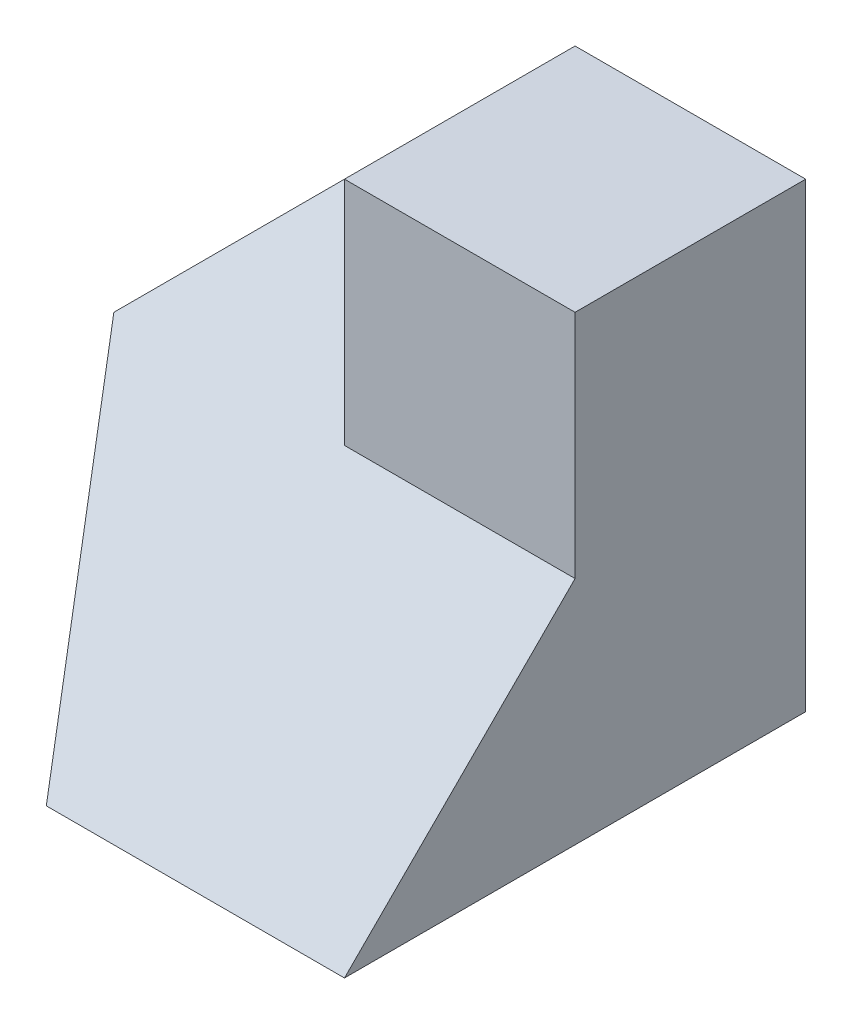
ISO-10303-21;
HEADER;
FILE_DESCRIPTION(('STEP AP214'),'2;1');
FILE_NAME('part.step','',(''),(''),'','','');
FILE_SCHEMA(('AUTOMOTIVE_DESIGN { 1 0 10303 214 1 1 1 1 }'));
ENDSEC;
DATA;
#1=APPLICATION_CONTEXT('core data for automotive mechanical design processes');
#2=APPLICATION_PROTOCOL_DEFINITION('international standard','automotive_design',2000,#1);
#3=PRODUCT_CONTEXT('',#1,'mechanical');
#4=PRODUCT('Part','Part','',(#3));
#5=PRODUCT_RELATED_PRODUCT_CATEGORY('part','',(#4));
#6=PRODUCT_DEFINITION_FORMATION('','',#4);
#7=PRODUCT_DEFINITION_CONTEXT('part definition',#1,'design');
#8=PRODUCT_DEFINITION('design','',#6,#7);
#9=PRODUCT_DEFINITION_SHAPE('','',#8);
#10=(LENGTH_UNIT() NAMED_UNIT(*) SI_UNIT(.MILLI.,.METRE.));
#11=(NAMED_UNIT(*) PLANE_ANGLE_UNIT() SI_UNIT($,.RADIAN.));
#12=(NAMED_UNIT(*) SI_UNIT($,.STERADIAN.) SOLID_ANGLE_UNIT());
#13=UNCERTAINTY_MEASURE_WITH_UNIT(LENGTH_MEASURE(1.E-05),#10,'distance_accuracy_value','');
#14=(GEOMETRIC_REPRESENTATION_CONTEXT(3) GLOBAL_UNCERTAINTY_ASSIGNED_CONTEXT((#13)) GLOBAL_UNIT_ASSIGNED_CONTEXT((#10,
#11,#12)) REPRESENTATION_CONTEXT('',''));
#15=CARTESIAN_POINT('',(0.,0.,0.));
#16=DIRECTION('',(0.,0.,1.));
#17=DIRECTION('',(1.,0.,0.));
#18=AXIS2_PLACEMENT_3D('',#15,#16,#17);
#19=CARTESIAN_POINT('',(0.,0.,40.));
#20=DIRECTION('',(1.,0.,0.));
#21=DIRECTION('',(0.,0.,-1.));
#22=AXIS2_PLACEMENT_3D('',#19,#20,#21);
#23=PLANE('',#22);
#24=DIRECTION('',(0.,-1.,0.));
#25=VECTOR('',#24,1.);
#26=CARTESIAN_POINT('',(0.,0.,0.));
#27=LINE('',#26,#25);
#28=CARTESIAN_POINT('',(0.,20.,0.));
#29=VERTEX_POINT('',#28);
#30=CARTESIAN_POINT('',(0.,-5.34294830600857E-13,0.));
#31=VERTEX_POINT('',#30);
#32=EDGE_CURVE('E124',#29,#31,#27,.T.);
#33=ORIENTED_EDGE('',*,*,#32,.T.);
#34=DIRECTION('',(0.,0.707106781186557,0.707106781186538));
#35=VECTOR('',#34,1.);
#36=CARTESIAN_POINT('',(0.,-8.28427124746228,-8.28427124746152));
#37=LINE('',#36,#35);
#38=CARTESIAN_POINT('',(0.,20.,20.));
#39=VERTEX_POINT('',#38);
#40=EDGE_CURVE('E151',#31,#39,#37,.T.);
#41=ORIENTED_EDGE('',*,*,#40,.T.);
#42=DIRECTION('',(0.,0.,1.));
#43=VECTOR('',#42,1.);
#44=CARTESIAN_POINT('',(0.,20.,0.));
#45=LINE('',#44,#43);
#46=EDGE_CURVE('E117',#29,#39,#45,.T.);
#47=ORIENTED_EDGE('',*,*,#46,.F.);
#48=EDGE_LOOP('',(#33,#41,#47));
#49=FACE_BOUND('',#48,.T.);
#50=ADVANCED_FACE('F33',(#49),#23,.F.);
#51=CARTESIAN_POINT('',(0.,0.,40.));
#52=DIRECTION('',(0.,1.,0.));
#53=DIRECTION('',(0.,0.,1.));
#54=AXIS2_PLACEMENT_3D('',#51,#52,#53);
#55=PLANE('',#54);
#56=DIRECTION('',(1.,0.,0.));
#57=VECTOR('',#56,1.);
#58=CARTESIAN_POINT('',(0.,0.,0.));
#59=LINE('',#58,#57);
#60=CARTESIAN_POINT('',(40.,0.,0.));
#61=VERTEX_POINT('',#60);
#62=EDGE_CURVE('E134',#31,#61,#59,.T.);
#63=ORIENTED_EDGE('',*,*,#62,.T.);
#64=DIRECTION('',(0.,0.,-1.));
#65=VECTOR('',#64,1.);
#66=CARTESIAN_POINT('',(40.,0.,40.));
#67=LINE('',#66,#65);
#68=CARTESIAN_POINT('',(40.,5.27355936696949E-13,40.));
#69=VERTEX_POINT('',#68);
#70=EDGE_CURVE('E118',#69,#61,#67,.T.);
#71=ORIENTED_EDGE('',*,*,#70,.F.);
#72=DIRECTION('',(1.,0.,0.));
#73=VECTOR('',#72,1.);
#74=CARTESIAN_POINT('',(0.,0.,40.));
#75=LINE('',#74,#73);
#76=CARTESIAN_POINT('',(14.1421356237311,1.34441069388203E-13,40.0000000000001));
#77=VERTEX_POINT('',#76);
#78=EDGE_CURVE('E95',#77,#69,#75,.T.);
#79=ORIENTED_EDGE('',*,*,#78,.F.);
#80=DIRECTION('',(-0.33333333333334,0.,-0.942809041582061));
#81=VECTOR('',#80,1.);
#82=CARTESIAN_POINT('',(12.5707872210942,0.,35.5555555555554));
#83=LINE('',#82,#81);
#84=EDGE_CURVE('E55',#77,#31,#83,.T.);
#85=ORIENTED_EDGE('',*,*,#84,.T.);
#86=EDGE_LOOP('',(#63,#71,#79,#85));
#87=FACE_BOUND('',#86,.T.);
#88=ADVANCED_FACE('F143',(#87),#55,.F.);
#89=CARTESIAN_POINT('',(40.,0.,40.));
#90=DIRECTION('',(-1.,0.,0.));
#91=DIRECTION('',(0.,0.,1.));
#92=AXIS2_PLACEMENT_3D('',#89,#90,#91);
#93=PLANE('',#92);
#94=ORIENTED_EDGE('',*,*,#70,.T.);
#95=DIRECTION('',(0.,1.,0.));
#96=VECTOR('',#95,1.);
#97=CARTESIAN_POINT('',(40.,0.,0.));
#98=LINE('',#97,#96);
#99=CARTESIAN_POINT('',(40.,39.9999999999995,0.));
#100=VERTEX_POINT('',#99);
#101=EDGE_CURVE('E96',#61,#100,#98,.T.);
#102=ORIENTED_EDGE('',*,*,#101,.T.);
#103=DIRECTION('',(0.,0.,1.));
#104=VECTOR('',#103,1.);
#105=CARTESIAN_POINT('',(40.,39.9999999999995,0.));
#106=LINE('',#105,#104);
#107=CARTESIAN_POINT('',(40.,39.9999999999995,20.));
#108=VERTEX_POINT('',#107);
#109=EDGE_CURVE('E90',#100,#108,#106,.T.);
#110=ORIENTED_EDGE('',*,*,#109,.T.);
#111=DIRECTION('',(0.,-1.,0.));
#112=VECTOR('',#111,1.);
#113=CARTESIAN_POINT('',(40.,39.9999999999995,20.));
#114=LINE('',#113,#112);
#115=CARTESIAN_POINT('',(40.,20.,20.));
#116=VERTEX_POINT('',#115);
#117=EDGE_CURVE('E47',#108,#116,#114,.T.);
#118=ORIENTED_EDGE('',*,*,#117,.T.);
#119=DIRECTION('',(0.,-0.707106781186538,0.707106781186557));
#120=VECTOR('',#119,1.);
#121=CARTESIAN_POINT('',(40.,20.,20.));
#122=LINE('',#121,#120);
#123=EDGE_CURVE('E125',#116,#69,#122,.T.);
#124=ORIENTED_EDGE('',*,*,#123,.T.);
#125=EDGE_LOOP('',(#94,#102,#110,#118,#124));
#126=FACE_BOUND('',#125,.T.);
#127=ADVANCED_FACE('F144',(#126),#93,.F.);
#128=CARTESIAN_POINT('',(0.,0.,0.));
#129=DIRECTION('',(0.,0.,-1.));
#130=DIRECTION('',(-1.,0.,0.));
#131=AXIS2_PLACEMENT_3D('',#128,#129,#130);
#132=PLANE('',#131);
#133=DIRECTION('',(0.707106781186548,0.707106781186548,0.));
#134=VECTOR('',#133,1.);
#135=CARTESIAN_POINT('',(20.,40.,0.));
#136=LINE('',#135,#134);
#137=CARTESIAN_POINT('',(20.,39.9999999999995,0.));
#138=VERTEX_POINT('',#137);
#139=EDGE_CURVE('E115',#29,#138,#136,.T.);
#140=ORIENTED_EDGE('',*,*,#139,.T.);
#141=DIRECTION('',(-1.,0.,0.));
#142=VECTOR('',#141,1.);
#143=CARTESIAN_POINT('',(0.,40.,0.));
#144=LINE('',#143,#142);
#145=EDGE_CURVE('E86',#100,#138,#144,.T.);
#146=ORIENTED_EDGE('',*,*,#145,.F.);
#147=ORIENTED_EDGE('',*,*,#101,.F.);
#148=ORIENTED_EDGE('',*,*,#62,.F.);
#149=ORIENTED_EDGE('',*,*,#32,.F.);
#150=EDGE_LOOP('',(#140,#146,#147,#148,#149));
#151=FACE_BOUND('',#150,.T.);
#152=ADVANCED_FACE('F121',(#151),#132,.T.);
#153=CARTESIAN_POINT('',(20.,40.,0.));
#154=DIRECTION('',(0.707106781186548,-0.707106781186548,0.));
#155=DIRECTION('',(0.707106781186548,0.707106781186548,0.));
#156=AXIS2_PLACEMENT_3D('',#153,#154,#155);
#157=PLANE('',#156);
#158=ORIENTED_EDGE('',*,*,#46,.T.);
#159=DIRECTION('',(0.577350269189621,0.577350269189621,-0.577350269189636));
#160=VECTOR('',#159,1.);
#161=CARTESIAN_POINT('',(19.9999999999998,39.9999999999998,-3.53270803203848E-13));
#162=LINE('',#161,#160);
#163=EDGE_CURVE('E110',#39,#138,#162,.T.);
#164=ORIENTED_EDGE('',*,*,#163,.T.);
#165=ORIENTED_EDGE('',*,*,#139,.F.);
#166=EDGE_LOOP('',(#158,#164,#165));
#167=FACE_BOUND('',#166,.T.);
#168=ADVANCED_FACE('F114',(#167),#157,.F.);
#169=CARTESIAN_POINT('',(40.,5.27355936696949E-13,40.));
#170=DIRECTION('',(0.,-0.707106781186557,-0.707106781186538));
#171=DIRECTION('',(0.,0.707106781186538,-0.707106781186557));
#172=AXIS2_PLACEMENT_3D('',#169,#170,#171);
#173=PLANE('',#172);
#174=ORIENTED_EDGE('',*,*,#123,.F.);
#175=DIRECTION('',(-1.,0.,0.));
#176=VECTOR('',#175,1.);
#177=CARTESIAN_POINT('',(40.,20.,20.));
#178=LINE('',#177,#176);
#179=CARTESIAN_POINT('',(20.,20.,20.));
#180=VERTEX_POINT('',#179);
#181=EDGE_CURVE('E11',#116,#180,#178,.T.);
#182=ORIENTED_EDGE('',*,*,#181,.T.);
#183=DIRECTION('',(0.,0.707106781186538,-0.707106781186557));
#184=VECTOR('',#183,1.);
#185=CARTESIAN_POINT('',(20.,5.27355936696949E-13,40.));
#186=LINE('',#185,#184);
#187=EDGE_CURVE('E40',#180,#138,#186,.T.);
#188=ORIENTED_EDGE('',*,*,#187,.T.);
#189=ORIENTED_EDGE('',*,*,#163,.F.);
#190=DIRECTION('',(0.447213595499961,-0.632455532033666,0.632455532033683));
#191=VECTOR('',#190,1.);
#192=CARTESIAN_POINT('',(19.3137084989848,-7.3137084989842,47.3137084989849));
#193=LINE('',#192,#191);
#194=EDGE_CURVE('E112',#39,#77,#193,.T.);
#195=ORIENTED_EDGE('',*,*,#194,.T.);
#196=ORIENTED_EDGE('',*,*,#78,.T.);
#197=EDGE_LOOP('',(#174,#182,#188,#189,#195,#196));
#198=FACE_BOUND('',#197,.T.);
#199=ADVANCED_FACE('F109',(#198),#173,.F.);
#200=CARTESIAN_POINT('',(0.,-8.28427124746228,-8.28427124746152));
#201=DIRECTION('',(0.894427190999914,0.316227766016836,-0.316227766016844));
#202=DIRECTION('',(-0.33333333333334,0.,-0.942809041582061));
#203=AXIS2_PLACEMENT_3D('',#200,#201,#202);
#204=PLANE('',#203);
#205=ORIENTED_EDGE('',*,*,#194,.F.);
#206=ORIENTED_EDGE('',*,*,#40,.F.);
#207=ORIENTED_EDGE('',*,*,#84,.F.);
#208=EDGE_LOOP('',(#205,#206,#207));
#209=FACE_BOUND('',#208,.T.);
#210=ADVANCED_FACE('F153',(#209),#204,.F.);
#211=CARTESIAN_POINT('',(20.,39.9999999999995,20.));
#212=DIRECTION('',(0.,0.,1.));
#213=DIRECTION('',(1.,0.,0.));
#214=AXIS2_PLACEMENT_3D('',#211,#212,#213);
#215=PLANE('',#214);
#216=ORIENTED_EDGE('',*,*,#181,.F.);
#217=ORIENTED_EDGE('',*,*,#117,.F.);
#218=DIRECTION('',(1.,0.,0.));
#219=VECTOR('',#218,1.);
#220=CARTESIAN_POINT('',(20.,39.9999999999995,20.));
#221=LINE('',#220,#219);
#222=CARTESIAN_POINT('',(20.,39.9999999999995,20.));
#223=VERTEX_POINT('',#222);
#224=EDGE_CURVE('E149',#223,#108,#221,.T.);
#225=ORIENTED_EDGE('',*,*,#224,.F.);
#226=DIRECTION('',(0.,-1.,0.));
#227=VECTOR('',#226,1.);
#228=CARTESIAN_POINT('',(20.,39.9999999999995,20.));
#229=LINE('',#228,#227);
#230=EDGE_CURVE('E103',#223,#180,#229,.T.);
#231=ORIENTED_EDGE('',*,*,#230,.T.);
#232=EDGE_LOOP('',(#216,#217,#225,#231));
#233=FACE_BOUND('',#232,.T.);
#234=ADVANCED_FACE('F155',(#233),#215,.T.);
#235=CARTESIAN_POINT('',(20.,0.,0.));
#236=DIRECTION('',(-1.,0.,0.));
#237=DIRECTION('',(0.,0.,1.));
#238=AXIS2_PLACEMENT_3D('',#235,#236,#237);
#239=PLANE('',#238);
#240=ORIENTED_EDGE('',*,*,#187,.F.);
#241=ORIENTED_EDGE('',*,*,#230,.F.);
#242=DIRECTION('',(0.,0.,1.));
#243=VECTOR('',#242,1.);
#244=CARTESIAN_POINT('',(20.,39.9999999999995,0.));
#245=LINE('',#244,#243);
#246=EDGE_CURVE('E89',#138,#223,#245,.T.);
#247=ORIENTED_EDGE('',*,*,#246,.F.);
#248=EDGE_LOOP('',(#240,#241,#247));
#249=FACE_BOUND('',#248,.T.);
#250=ADVANCED_FACE('F101',(#249),#239,.T.);
#251=CARTESIAN_POINT('',(20.,39.9999999999995,0.));
#252=DIRECTION('',(0.,1.,0.));
#253=DIRECTION('',(0.,0.,1.));
#254=AXIS2_PLACEMENT_3D('',#251,#252,#253);
#255=PLANE('',#254);
#256=ORIENTED_EDGE('',*,*,#109,.F.);
#257=ORIENTED_EDGE('',*,*,#145,.T.);
#258=ORIENTED_EDGE('',*,*,#246,.T.);
#259=ORIENTED_EDGE('',*,*,#224,.T.);
#260=EDGE_LOOP('',(#256,#257,#258,#259));
#261=FACE_BOUND('',#260,.T.);
#262=ADVANCED_FACE('F88',(#261),#255,.T.);
#263=CLOSED_SHELL('',(#50,#88,#127,#152,#168,#199,#210,#234,#250,#262));
#264=MANIFOLD_SOLID_BREP('B2',#263);
#265=ADVANCED_BREP_SHAPE_REPRESENTATION('',(#18,#264),#14);
#266=SHAPE_DEFINITION_REPRESENTATION(#9,#265);
ENDSEC;
END-ISO-10303-21;
